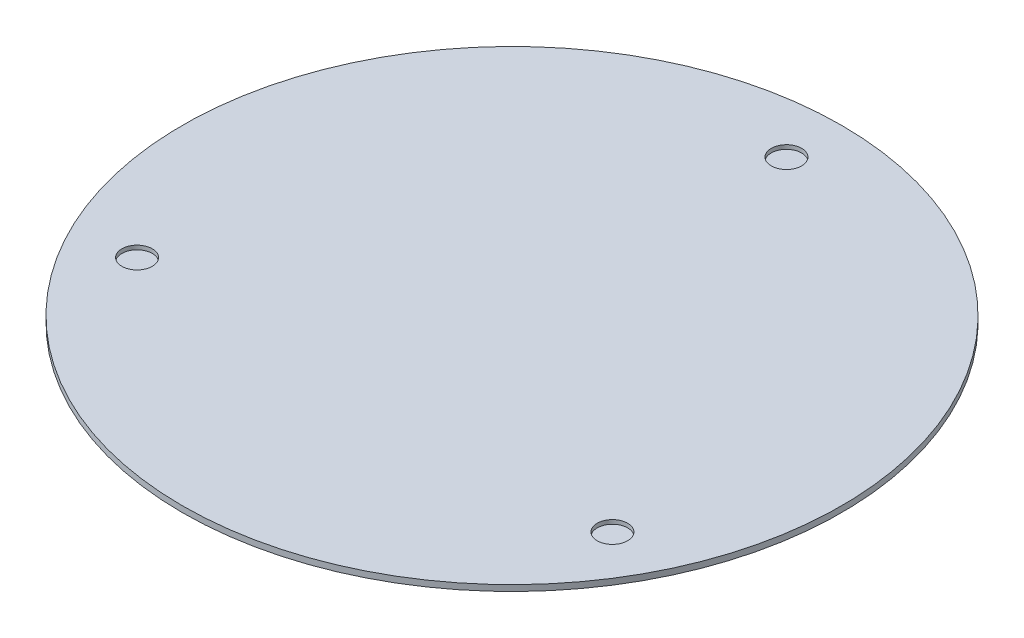
ISO-10303-21;
HEADER;
FILE_DESCRIPTION(('STEP AP214'),'2;1');
FILE_NAME('part.step','',(''),(''),'','','');
FILE_SCHEMA(('AUTOMOTIVE_DESIGN { 1 0 10303 214 1 1 1 1 }'));
ENDSEC;
DATA;
#1=APPLICATION_CONTEXT('core data for automotive mechanical design processes');
#2=APPLICATION_PROTOCOL_DEFINITION('international standard','automotive_design',2000,#1);
#3=PRODUCT_CONTEXT('',#1,'mechanical');
#4=PRODUCT('Part','Part','',(#3));
#5=PRODUCT_RELATED_PRODUCT_CATEGORY('part','',(#4));
#6=PRODUCT_DEFINITION_FORMATION('','',#4);
#7=PRODUCT_DEFINITION_CONTEXT('part definition',#1,'design');
#8=PRODUCT_DEFINITION('design','',#6,#7);
#9=PRODUCT_DEFINITION_SHAPE('','',#8);
#10=(LENGTH_UNIT() NAMED_UNIT(*) SI_UNIT(.MILLI.,.METRE.));
#11=(NAMED_UNIT(*) PLANE_ANGLE_UNIT() SI_UNIT($,.RADIAN.));
#12=(NAMED_UNIT(*) SI_UNIT($,.STERADIAN.) SOLID_ANGLE_UNIT());
#13=UNCERTAINTY_MEASURE_WITH_UNIT(LENGTH_MEASURE(1.E-05),#10,'distance_accuracy_value','');
#14=(GEOMETRIC_REPRESENTATION_CONTEXT(3) GLOBAL_UNCERTAINTY_ASSIGNED_CONTEXT((#13)) GLOBAL_UNIT_ASSIGNED_CONTEXT((#10,
#11,#12)) REPRESENTATION_CONTEXT('',''));
#15=CARTESIAN_POINT('',(0.,0.,0.));
#16=DIRECTION('',(0.,0.,1.));
#17=DIRECTION('',(1.,0.,0.));
#18=AXIS2_PLACEMENT_3D('',#15,#16,#17);
#19=CARTESIAN_POINT('',(0.,3.,0.));
#20=DIRECTION('',(0.,-1.,0.));
#21=DIRECTION('',(0.,0.,-1.));
#22=AXIS2_PLACEMENT_3D('',#19,#20,#21);
#23=CYLINDRICAL_SURFACE('',#22,165.1);
#24=CARTESIAN_POINT('',(0.,3.,0.));
#25=DIRECTION('',(0.,1.,0.));
#26=DIRECTION('',(0.,0.,1.));
#27=AXIS2_PLACEMENT_3D('',#24,#25,#26);
#28=CIRCLE('',#27,165.1);
#29=CARTESIAN_POINT('',(0.,3.,165.1));
#30=VERTEX_POINT('',#29);
#31=EDGE_CURVE('E10',#30,#30,#28,.T.);
#32=ORIENTED_EDGE('',*,*,#31,.F.);
#33=EDGE_LOOP('',(#32));
#34=FACE_BOUND('',#33,.T.);
#35=CARTESIAN_POINT('',(0.,0.,0.));
#36=DIRECTION('',(0.,1.,0.));
#37=DIRECTION('',(0.,0.,1.));
#38=AXIS2_PLACEMENT_3D('',#35,#36,#37);
#39=CIRCLE('',#38,165.1);
#40=CARTESIAN_POINT('',(0.,0.,165.1));
#41=VERTEX_POINT('',#40);
#42=EDGE_CURVE('E35',#41,#41,#39,.T.);
#43=ORIENTED_EDGE('',*,*,#42,.T.);
#44=EDGE_LOOP('',(#43));
#45=FACE_BOUND('',#44,.T.);
#46=ADVANCED_FACE('F32',(#34,#45),#23,.T.);
#47=CARTESIAN_POINT('',(0.,3.,0.));
#48=DIRECTION('',(0.,1.,0.));
#49=DIRECTION('',(0.,0.,1.));
#50=AXIS2_PLACEMENT_3D('',#47,#48,#49);
#51=PLANE('',#50);
#52=CARTESIAN_POINT('',(-119.070005971397,3.,68.7451000000034));
#53=DIRECTION('',(0.,1.,0.));
#54=DIRECTION('',(0.,0.,1.));
#55=AXIS2_PLACEMENT_3D('',#52,#53,#54);
#56=CIRCLE('',#55,7.62000000000784);
#57=CARTESIAN_POINT('',(-119.070005971397,3.,76.3651000000113));
#58=VERTEX_POINT('',#57);
#59=EDGE_CURVE('E58',#58,#58,#56,.T.);
#60=ORIENTED_EDGE('',*,*,#59,.F.);
#61=EDGE_LOOP('',(#60));
#62=FACE_BOUND('',#61,.T.);
#63=CARTESIAN_POINT('',(119.070005971409,3.,68.7450999999966));
#64=DIRECTION('',(0.,1.,0.));
#65=DIRECTION('',(0.,0.,1.));
#66=AXIS2_PLACEMENT_3D('',#63,#64,#65);
#67=CIRCLE('',#66,7.62000000000523);
#68=CARTESIAN_POINT('',(119.070005971409,3.,76.3651000000018));
#69=VERTEX_POINT('',#68);
#70=EDGE_CURVE('E51',#69,#69,#67,.T.);
#71=ORIENTED_EDGE('',*,*,#70,.F.);
#72=EDGE_LOOP('',(#71));
#73=FACE_BOUND('',#72,.T.);
#74=CARTESIAN_POINT('',(0.,3.,-137.4902));
#75=DIRECTION('',(0.,1.,0.));
#76=DIRECTION('',(0.,0.,1.));
#77=AXIS2_PLACEMENT_3D('',#74,#75,#76);
#78=CIRCLE('',#77,7.62);
#79=CARTESIAN_POINT('',(0.,3.,-129.8702));
#80=VERTEX_POINT('',#79);
#81=EDGE_CURVE('E44',#80,#80,#78,.T.);
#82=ORIENTED_EDGE('',*,*,#81,.F.);
#83=EDGE_LOOP('',(#82));
#84=FACE_BOUND('',#83,.T.);
#85=ORIENTED_EDGE('',*,*,#31,.T.);
#86=EDGE_LOOP('',(#85));
#87=FACE_BOUND('',#86,.T.);
#88=ADVANCED_FACE('F74',(#62,#73,#84,#87),#51,.T.);
#89=CARTESIAN_POINT('',(0.,0.,0.));
#90=DIRECTION('',(0.,1.,0.));
#91=DIRECTION('',(0.,0.,1.));
#92=AXIS2_PLACEMENT_3D('',#89,#90,#91);
#93=PLANE('',#92);
#94=ORIENTED_EDGE('',*,*,#42,.F.);
#95=EDGE_LOOP('',(#94));
#96=FACE_BOUND('',#95,.T.);
#97=ADVANCED_FACE('F77',(#96),#93,.F.);
#98=CARTESIAN_POINT('',(0.,0.968,-137.4902));
#99=DIRECTION('',(0.,1.,0.));
#100=DIRECTION('',(0.,0.,1.));
#101=AXIS2_PLACEMENT_3D('',#98,#99,#100);
#102=CYLINDRICAL_SURFACE('',#101,7.62);
#103=CARTESIAN_POINT('',(0.,0.968,-137.4902));
#104=DIRECTION('',(0.,1.,0.));
#105=DIRECTION('',(0.,0.,1.));
#106=AXIS2_PLACEMENT_3D('',#103,#104,#105);
#107=CIRCLE('',#106,7.62);
#108=CARTESIAN_POINT('',(0.,0.968,-129.8702));
#109=VERTEX_POINT('',#108);
#110=EDGE_CURVE('E42',#109,#109,#107,.T.);
#111=ORIENTED_EDGE('',*,*,#110,.F.);
#112=EDGE_LOOP('',(#111));
#113=FACE_BOUND('',#112,.T.);
#114=ORIENTED_EDGE('',*,*,#81,.T.);
#115=EDGE_LOOP('',(#114));
#116=FACE_BOUND('',#115,.T.);
#117=ADVANCED_FACE('F83',(#113,#116),#102,.F.);
#118=CARTESIAN_POINT('',(0.,0.968,-137.4902));
#119=DIRECTION('',(0.,1.,0.));
#120=DIRECTION('',(0.,0.,1.));
#121=AXIS2_PLACEMENT_3D('',#118,#119,#120);
#122=PLANE('',#121);
#123=ORIENTED_EDGE('',*,*,#110,.T.);
#124=EDGE_LOOP('',(#123));
#125=FACE_BOUND('',#124,.T.);
#126=ADVANCED_FACE('F85',(#125),#122,.T.);
#127=CARTESIAN_POINT('',(119.070005971409,0.968,68.7450999999966));
#128=DIRECTION('',(0.,1.,0.));
#129=DIRECTION('',(0.,0.,1.));
#130=AXIS2_PLACEMENT_3D('',#127,#128,#129);
#131=CYLINDRICAL_SURFACE('',#130,7.62000000000523);
#132=CARTESIAN_POINT('',(119.070005971409,0.968,68.7450999999966));
#133=DIRECTION('',(0.,1.,0.));
#134=DIRECTION('',(0.,0.,1.));
#135=AXIS2_PLACEMENT_3D('',#132,#133,#134);
#136=CIRCLE('',#135,7.62000000000523);
#137=CARTESIAN_POINT('',(119.070005971409,0.968,76.3651000000018));
#138=VERTEX_POINT('',#137);
#139=EDGE_CURVE('E48',#138,#138,#136,.T.);
#140=ORIENTED_EDGE('',*,*,#139,.F.);
#141=EDGE_LOOP('',(#140));
#142=FACE_BOUND('',#141,.T.);
#143=ORIENTED_EDGE('',*,*,#70,.T.);
#144=EDGE_LOOP('',(#143));
#145=FACE_BOUND('',#144,.T.);
#146=ADVANCED_FACE('F92',(#142,#145),#131,.F.);
#147=CARTESIAN_POINT('',(119.070005971409,0.968,68.7450999999966));
#148=DIRECTION('',(0.,1.,0.));
#149=DIRECTION('',(0.,0.,1.));
#150=AXIS2_PLACEMENT_3D('',#147,#148,#149);
#151=PLANE('',#150);
#152=ORIENTED_EDGE('',*,*,#139,.T.);
#153=EDGE_LOOP('',(#152));
#154=FACE_BOUND('',#153,.T.);
#155=ADVANCED_FACE('F70',(#154),#151,.T.);
#156=CARTESIAN_POINT('',(-119.070005971397,0.968,68.7451000000034));
#157=DIRECTION('',(0.,1.,0.));
#158=DIRECTION('',(0.,0.,1.));
#159=AXIS2_PLACEMENT_3D('',#156,#157,#158);
#160=CYLINDRICAL_SURFACE('',#159,7.62000000000784);
#161=CARTESIAN_POINT('',(-119.070005971397,0.968,68.7451000000034));
#162=DIRECTION('',(0.,1.,0.));
#163=DIRECTION('',(0.,0.,1.));
#164=AXIS2_PLACEMENT_3D('',#161,#162,#163);
#165=CIRCLE('',#164,7.62000000000784);
#166=CARTESIAN_POINT('',(-119.070005971397,0.968,76.3651000000113));
#167=VERTEX_POINT('',#166);
#168=EDGE_CURVE('E55',#167,#167,#165,.T.);
#169=ORIENTED_EDGE('',*,*,#168,.F.);
#170=EDGE_LOOP('',(#169));
#171=FACE_BOUND('',#170,.T.);
#172=ORIENTED_EDGE('',*,*,#59,.T.);
#173=EDGE_LOOP('',(#172));
#174=FACE_BOUND('',#173,.T.);
#175=ADVANCED_FACE('F67',(#171,#174),#160,.F.);
#176=CARTESIAN_POINT('',(-119.070005971397,0.968,68.7451000000034));
#177=DIRECTION('',(0.,1.,0.));
#178=DIRECTION('',(0.,0.,1.));
#179=AXIS2_PLACEMENT_3D('',#176,#177,#178);
#180=PLANE('',#179);
#181=ORIENTED_EDGE('',*,*,#168,.T.);
#182=EDGE_LOOP('',(#181));
#183=FACE_BOUND('',#182,.T.);
#184=ADVANCED_FACE('F65',(#183),#180,.T.);
#185=CLOSED_SHELL('',(#46,#88,#97,#117,#126,#146,#155,#175,#184));
#186=MANIFOLD_SOLID_BREP('B2',#185);
#187=ADVANCED_BREP_SHAPE_REPRESENTATION('',(#18,#186),#14);
#188=SHAPE_DEFINITION_REPRESENTATION(#9,#187);
ENDSEC;
END-ISO-10303-21;
